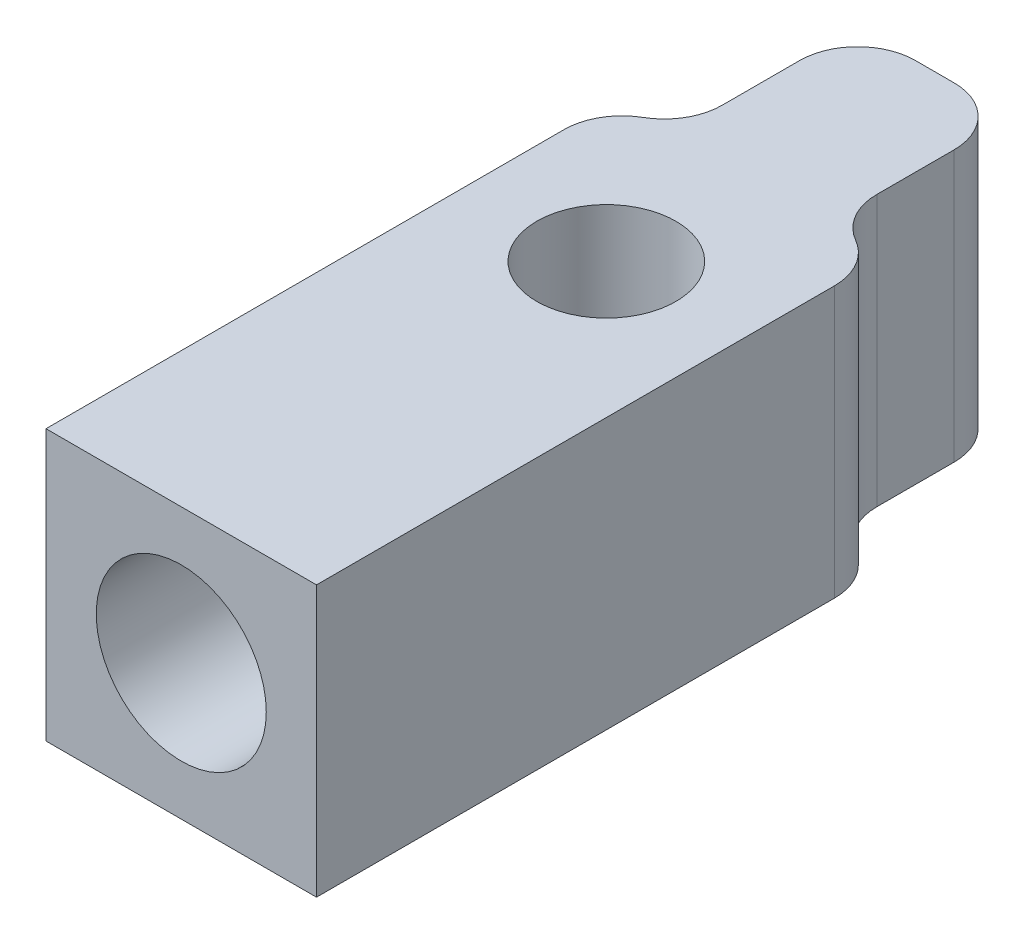
ISO-10303-21;
HEADER;
FILE_DESCRIPTION(('STEP AP214'),'2;1');
FILE_NAME('part.step','',(''),(''),'','','');
FILE_SCHEMA(('AUTOMOTIVE_DESIGN { 1 0 10303 214 1 1 1 1 }'));
ENDSEC;
DATA;
#1=APPLICATION_CONTEXT('core data for automotive mechanical design processes');
#2=APPLICATION_PROTOCOL_DEFINITION('international standard','automotive_design',2000,#1);
#3=PRODUCT_CONTEXT('',#1,'mechanical');
#4=PRODUCT('Part','Part','',(#3));
#5=PRODUCT_RELATED_PRODUCT_CATEGORY('part','',(#4));
#6=PRODUCT_DEFINITION_FORMATION('','',#4);
#7=PRODUCT_DEFINITION_CONTEXT('part definition',#1,'design');
#8=PRODUCT_DEFINITION('design','',#6,#7);
#9=PRODUCT_DEFINITION_SHAPE('','',#8);
#10=(LENGTH_UNIT() NAMED_UNIT(*) SI_UNIT(.MILLI.,.METRE.));
#11=(NAMED_UNIT(*) PLANE_ANGLE_UNIT() SI_UNIT($,.RADIAN.));
#12=(NAMED_UNIT(*) SI_UNIT($,.STERADIAN.) SOLID_ANGLE_UNIT());
#13=UNCERTAINTY_MEASURE_WITH_UNIT(LENGTH_MEASURE(1.E-05),#10,'distance_accuracy_value','');
#14=(GEOMETRIC_REPRESENTATION_CONTEXT(3) GLOBAL_UNCERTAINTY_ASSIGNED_CONTEXT((#13)) GLOBAL_UNIT_ASSIGNED_CONTEXT((#10,
#11,#12)) REPRESENTATION_CONTEXT('',''));
#15=CARTESIAN_POINT('',(0.,0.,0.));
#16=DIRECTION('',(0.,0.,1.));
#17=DIRECTION('',(1.,0.,0.));
#18=AXIS2_PLACEMENT_3D('',#15,#16,#17);
#19=CARTESIAN_POINT('',(-3.49999999999999,0.,0.));
#20=DIRECTION('',(-1.,0.,0.));
#21=DIRECTION('',(0.,-1.,0.));
#22=AXIS2_PLACEMENT_3D('',#19,#20,#21);
#23=PLANE('',#22);
#24=DIRECTION('',(0.,0.,-1.));
#25=VECTOR('',#24,1.);
#26=CARTESIAN_POINT('',(-3.49999999999999,8.5,11.));
#27=LINE('',#26,#25);
#28=CARTESIAN_POINT('',(-3.49999999999999,8.5,11.));
#29=VERTEX_POINT('',#28);
#30=CARTESIAN_POINT('',(-3.49999999999999,8.5,-2.4019237714403));
#31=VERTEX_POINT('',#30);
#32=EDGE_CURVE('E187',#29,#31,#27,.T.);
#33=ORIENTED_EDGE('',*,*,#32,.T.);
#34=DIRECTION('',(0.,1.,0.));
#35=VECTOR('',#34,1.);
#36=CARTESIAN_POINT('',(-3.49999999999999,1.5,-2.4019237714403));
#37=LINE('',#36,#35);
#38=CARTESIAN_POINT('',(-3.49999999999999,1.5,-2.4019237714403));
#39=VERTEX_POINT('',#38);
#40=EDGE_CURVE('E158',#39,#31,#37,.T.);
#41=ORIENTED_EDGE('',*,*,#40,.F.);
#42=DIRECTION('',(0.,0.,1.));
#43=VECTOR('',#42,1.);
#44=CARTESIAN_POINT('',(-3.49999999999999,1.5,-8.49999999999999));
#45=LINE('',#44,#43);
#46=CARTESIAN_POINT('',(-3.49999999999999,1.5,11.));
#47=VERTEX_POINT('',#46);
#48=EDGE_CURVE('E145',#39,#47,#45,.T.);
#49=ORIENTED_EDGE('',*,*,#48,.T.);
#50=DIRECTION('',(0.,1.,0.));
#51=VECTOR('',#50,1.);
#52=CARTESIAN_POINT('',(-3.49999999999999,1.5,11.));
#53=LINE('',#52,#51);
#54=EDGE_CURVE('E195',#47,#29,#53,.T.);
#55=ORIENTED_EDGE('',*,*,#54,.T.);
#56=EDGE_LOOP('',(#33,#41,#49,#55));
#57=FACE_BOUND('',#56,.T.);
#58=ADVANCED_FACE('F33',(#57),#23,.T.);
#59=CARTESIAN_POINT('',(3.49999999999999,8.5,11.));
#60=DIRECTION('',(0.,1.,0.));
#61=DIRECTION('',(-1.,0.,0.));
#62=AXIS2_PLACEMENT_3D('',#59,#60,#61);
#63=PLANE('',#62);
#64=CARTESIAN_POINT('',(0.,8.5,0.));
#65=DIRECTION('',(0.,1.,0.));
#66=DIRECTION('',(-1.,0.,0.));
#67=AXIS2_PLACEMENT_3D('',#64,#65,#66);
#68=CIRCLE('',#67,1.8);
#69=CARTESIAN_POINT('',(-1.8,8.5,0.));
#70=VERTEX_POINT('',#69);
#71=EDGE_CURVE('E156',#70,#70,#68,.T.);
#72=ORIENTED_EDGE('',*,*,#71,.F.);
#73=EDGE_LOOP('',(#72));
#74=FACE_BOUND('',#73,.T.);
#75=DIRECTION('',(-1.,0.,0.));
#76=VECTOR('',#75,1.);
#77=CARTESIAN_POINT('',(3.49999999999999,8.5,-8.49999999999999));
#78=LINE('',#77,#76);
#79=CARTESIAN_POINT('',(0.500000029802321,8.5,-8.49999999999999));
#80=VERTEX_POINT('',#79);
#81=CARTESIAN_POINT('',(-0.499999970197678,8.5,-8.49999999999999));
#82=VERTEX_POINT('',#81);
#83=EDGE_CURVE('E200',#80,#82,#78,.T.);
#84=ORIENTED_EDGE('',*,*,#83,.T.);
#85=CARTESIAN_POINT('',(-0.49999997019768,8.5,-6.99999999999999));
#86=DIRECTION('',(0.,1.,0.));
#87=DIRECTION('',(-1.,0.,0.));
#88=AXIS2_PLACEMENT_3D('',#85,#86,#87);
#89=CIRCLE('',#88,1.5);
#90=CARTESIAN_POINT('',(-1.99999997019768,8.5,-6.99999999999999));
#91=VERTEX_POINT('',#90);
#92=EDGE_CURVE('E216',#82,#91,#89,.T.);
#93=ORIENTED_EDGE('',*,*,#92,.T.);
#94=DIRECTION('',(0.,0.,-1.));
#95=VECTOR('',#94,1.);
#96=CARTESIAN_POINT('',(-1.99999997019768,8.5,-4.99999999999999));
#97=LINE('',#96,#95);
#98=CARTESIAN_POINT('',(-1.99999997019768,8.5,-4.99999999999999));
#99=VERTEX_POINT('',#98);
#100=EDGE_CURVE('E146',#99,#91,#97,.T.);
#101=ORIENTED_EDGE('',*,*,#100,.F.);
#102=CARTESIAN_POINT('',(-3.49999997019768,8.5,-4.99999999999999));
#103=DIRECTION('',(0.,1.,0.));
#104=DIRECTION('',(-1.,0.,0.));
#105=AXIS2_PLACEMENT_3D('',#102,#103,#104);
#106=CIRCLE('',#105,1.5);
#107=CARTESIAN_POINT('',(-2.74999998509883,8.5,-3.70096188572015));
#108=VERTEX_POINT('',#107);
#109=EDGE_CURVE('E148',#108,#99,#106,.T.);
#110=ORIENTED_EDGE('',*,*,#109,.F.);
#111=CARTESIAN_POINT('',(-1.99999999999999,8.5,-2.4019237714403));
#112=DIRECTION('',(0.,-1.,0.));
#113=DIRECTION('',(1.,0.,0.));
#114=AXIS2_PLACEMENT_3D('',#111,#112,#113);
#115=CIRCLE('',#114,1.5);
#116=EDGE_CURVE('E131',#31,#108,#115,.T.);
#117=ORIENTED_EDGE('',*,*,#116,.F.);
#118=ORIENTED_EDGE('',*,*,#32,.F.);
#119=DIRECTION('',(-1.,0.,0.));
#120=VECTOR('',#119,1.);
#121=CARTESIAN_POINT('',(3.49999999999999,8.5,11.));
#122=LINE('',#121,#120);
#123=CARTESIAN_POINT('',(3.49999999999999,8.5,11.));
#124=VERTEX_POINT('',#123);
#125=EDGE_CURVE('E204',#124,#29,#122,.T.);
#126=ORIENTED_EDGE('',*,*,#125,.F.);
#127=DIRECTION('',(0.,0.,-1.));
#128=VECTOR('',#127,1.);
#129=CARTESIAN_POINT('',(3.49999999999999,8.5,11.));
#130=LINE('',#129,#128);
#131=CARTESIAN_POINT('',(3.49999999999999,8.5,-2.40192380585306));
#132=VERTEX_POINT('',#131);
#133=EDGE_CURVE('E190',#124,#132,#130,.T.);
#134=ORIENTED_EDGE('',*,*,#133,.T.);
#135=CARTESIAN_POINT('',(1.99999999999999,8.5,-2.40192380585306));
#136=DIRECTION('',(0.,-1.,0.));
#137=DIRECTION('',(1.,0.,0.));
#138=AXIS2_PLACEMENT_3D('',#135,#136,#137);
#139=CIRCLE('',#138,1.5);
#140=CARTESIAN_POINT('',(2.75000001490115,8.5,-3.70096190292653));
#141=VERTEX_POINT('',#140);
#142=EDGE_CURVE('E174',#141,#132,#139,.T.);
#143=ORIENTED_EDGE('',*,*,#142,.F.);
#144=CARTESIAN_POINT('',(3.50000002980232,8.5,-4.99999999999999));
#145=DIRECTION('',(0.,1.,0.));
#146=DIRECTION('',(-1.,0.,0.));
#147=AXIS2_PLACEMENT_3D('',#144,#145,#146);
#148=CIRCLE('',#147,1.5);
#149=CARTESIAN_POINT('',(2.00000002980232,8.5,-4.99999999999999));
#150=VERTEX_POINT('',#149);
#151=EDGE_CURVE('E160',#150,#141,#148,.T.);
#152=ORIENTED_EDGE('',*,*,#151,.F.);
#153=DIRECTION('',(0.,0.,1.));
#154=VECTOR('',#153,1.);
#155=CARTESIAN_POINT('',(2.00000002980232,8.5,-8.49999999999999));
#156=LINE('',#155,#154);
#157=CARTESIAN_POINT('',(2.00000002980232,8.5,-6.99999999999999));
#158=VERTEX_POINT('',#157);
#159=EDGE_CURVE('E166',#158,#150,#156,.T.);
#160=ORIENTED_EDGE('',*,*,#159,.F.);
#161=CARTESIAN_POINT('',(0.50000002980232,8.5,-6.99999999999999));
#162=DIRECTION('',(0.,1.,0.));
#163=DIRECTION('',(-1.,0.,0.));
#164=AXIS2_PLACEMENT_3D('',#161,#162,#163);
#165=CIRCLE('',#164,1.5);
#166=EDGE_CURVE('E214',#158,#80,#165,.T.);
#167=ORIENTED_EDGE('',*,*,#166,.T.);
#168=EDGE_LOOP('',(#84,#93,#101,#110,#117,#118,#126,#134,#143,#152,#160,#167));
#169=FACE_BOUND('',#168,.T.);
#170=ADVANCED_FACE('F229',(#74,#169),#63,.T.);
#171=CARTESIAN_POINT('',(3.49999999999999,1.5,-8.49999999999999));
#172=DIRECTION('',(0.,-1.,0.));
#173=DIRECTION('',(1.,0.,0.));
#174=AXIS2_PLACEMENT_3D('',#171,#172,#173);
#175=PLANE('',#174);
#176=CARTESIAN_POINT('',(0.,1.5,0.));
#177=DIRECTION('',(0.,-1.,0.));
#178=DIRECTION('',(1.,0.,0.));
#179=AXIS2_PLACEMENT_3D('',#176,#177,#178);
#180=CIRCLE('',#179,1.8);
#181=CARTESIAN_POINT('',(1.8,1.5,0.));
#182=VERTEX_POINT('',#181);
#183=EDGE_CURVE('E151',#182,#182,#180,.F.);
#184=ORIENTED_EDGE('',*,*,#183,.T.);
#185=EDGE_LOOP('',(#184));
#186=FACE_BOUND('',#185,.T.);
#187=DIRECTION('',(0.,0.,-1.));
#188=VECTOR('',#187,1.);
#189=CARTESIAN_POINT('',(-1.99999997019768,1.5,-4.99999999999999));
#190=LINE('',#189,#188);
#191=CARTESIAN_POINT('',(-1.99999997019768,1.5,-4.99999999999999));
#192=VERTEX_POINT('',#191);
#193=CARTESIAN_POINT('',(-1.99999997019768,1.5,-6.99999999999999));
#194=VERTEX_POINT('',#193);
#195=EDGE_CURVE('E136',#192,#194,#190,.T.);
#196=ORIENTED_EDGE('',*,*,#195,.T.);
#197=CARTESIAN_POINT('',(-0.499999970197678,1.5,-6.99999999999999));
#198=DIRECTION('',(0.,-1.,0.));
#199=DIRECTION('',(1.,0.,0.));
#200=AXIS2_PLACEMENT_3D('',#197,#198,#199);
#201=CIRCLE('',#200,1.5);
#202=CARTESIAN_POINT('',(-0.499999970197677,1.5,-8.49999999999999));
#203=VERTEX_POINT('',#202);
#204=EDGE_CURVE('E41',#194,#203,#201,.T.);
#205=ORIENTED_EDGE('',*,*,#204,.T.);
#206=DIRECTION('',(-1.,0.,0.));
#207=VECTOR('',#206,1.);
#208=CARTESIAN_POINT('',(3.49999999999999,1.5,-8.49999999999999));
#209=LINE('',#208,#207);
#210=CARTESIAN_POINT('',(0.500000029802322,1.5,-8.49999999999999));
#211=VERTEX_POINT('',#210);
#212=EDGE_CURVE('E193',#211,#203,#209,.T.);
#213=ORIENTED_EDGE('',*,*,#212,.F.);
#214=CARTESIAN_POINT('',(0.500000029802321,1.5,-6.99999999999999));
#215=DIRECTION('',(0.,-1.,0.));
#216=DIRECTION('',(1.,0.,0.));
#217=AXIS2_PLACEMENT_3D('',#214,#215,#216);
#218=CIRCLE('',#217,1.5);
#219=CARTESIAN_POINT('',(2.00000002980232,1.5,-6.99999999999999));
#220=VERTEX_POINT('',#219);
#221=EDGE_CURVE('E48',#211,#220,#218,.T.);
#222=ORIENTED_EDGE('',*,*,#221,.T.);
#223=DIRECTION('',(0.,0.,1.));
#224=VECTOR('',#223,1.);
#225=CARTESIAN_POINT('',(2.00000002980232,1.5,-8.49999999999999));
#226=LINE('',#225,#224);
#227=CARTESIAN_POINT('',(2.00000002980232,1.5,-4.99999999999999));
#228=VERTEX_POINT('',#227);
#229=EDGE_CURVE('E169',#220,#228,#226,.T.);
#230=ORIENTED_EDGE('',*,*,#229,.T.);
#231=CARTESIAN_POINT('',(3.50000002980232,1.5,-4.99999999999999));
#232=DIRECTION('',(0.,1.,0.));
#233=DIRECTION('',(-1.,0.,0.));
#234=AXIS2_PLACEMENT_3D('',#231,#232,#233);
#235=CIRCLE('',#234,1.5);
#236=CARTESIAN_POINT('',(2.75000001490116,1.5,-3.70096190292653));
#237=VERTEX_POINT('',#236);
#238=EDGE_CURVE('E162',#228,#237,#235,.T.);
#239=ORIENTED_EDGE('',*,*,#238,.T.);
#240=CARTESIAN_POINT('',(1.99999999999999,1.5,-2.40192380585306));
#241=DIRECTION('',(0.,-1.,0.));
#242=DIRECTION('',(1.,0.,0.));
#243=AXIS2_PLACEMENT_3D('',#240,#241,#242);
#244=CIRCLE('',#243,1.5);
#245=CARTESIAN_POINT('',(3.49999999999999,1.5,-2.40192380585306));
#246=VERTEX_POINT('',#245);
#247=EDGE_CURVE('E165',#237,#246,#244,.T.);
#248=ORIENTED_EDGE('',*,*,#247,.T.);
#249=DIRECTION('',(0.,0.,1.));
#250=VECTOR('',#249,1.);
#251=CARTESIAN_POINT('',(3.49999999999999,1.5,-8.49999999999999));
#252=LINE('',#251,#250);
#253=CARTESIAN_POINT('',(3.49999999999999,1.5,11.));
#254=VERTEX_POINT('',#253);
#255=EDGE_CURVE('E184',#246,#254,#252,.T.);
#256=ORIENTED_EDGE('',*,*,#255,.T.);
#257=DIRECTION('',(-1.,0.,0.));
#258=VECTOR('',#257,1.);
#259=CARTESIAN_POINT('',(3.49999999999999,1.5,11.));
#260=LINE('',#259,#258);
#261=EDGE_CURVE('E206',#254,#47,#260,.T.);
#262=ORIENTED_EDGE('',*,*,#261,.T.);
#263=ORIENTED_EDGE('',*,*,#48,.F.);
#264=CARTESIAN_POINT('',(-1.99999999999999,1.5,-2.4019237714403));
#265=DIRECTION('',(0.,-1.,0.));
#266=DIRECTION('',(1.,0.,0.));
#267=AXIS2_PLACEMENT_3D('',#264,#265,#266);
#268=CIRCLE('',#267,1.5);
#269=CARTESIAN_POINT('',(-2.74999998509883,1.5,-3.70096188572015));
#270=VERTEX_POINT('',#269);
#271=EDGE_CURVE('E128',#39,#270,#268,.T.);
#272=ORIENTED_EDGE('',*,*,#271,.T.);
#273=CARTESIAN_POINT('',(-3.49999997019768,1.5,-4.99999999999999));
#274=DIRECTION('',(0.,1.,0.));
#275=DIRECTION('',(-1.,0.,0.));
#276=AXIS2_PLACEMENT_3D('',#273,#274,#275);
#277=CIRCLE('',#276,1.5);
#278=EDGE_CURVE('E139',#270,#192,#277,.T.);
#279=ORIENTED_EDGE('',*,*,#278,.T.);
#280=EDGE_LOOP('',(#196,#205,#213,#222,#230,#239,#248,#256,#262,#263,#272,#279));
#281=FACE_BOUND('',#280,.T.);
#282=ADVANCED_FACE('F143',(#186,#281),#175,.T.);
#283=CARTESIAN_POINT('',(3.49999999999999,0.,0.));
#284=DIRECTION('',(-1.,0.,0.));
#285=DIRECTION('',(0.,-1.,0.));
#286=AXIS2_PLACEMENT_3D('',#283,#284,#285);
#287=PLANE('',#286);
#288=DIRECTION('',(0.,1.,0.));
#289=VECTOR('',#288,1.);
#290=CARTESIAN_POINT('',(3.49999999999999,1.5,-2.40192380585306));
#291=LINE('',#290,#289);
#292=EDGE_CURVE('E180',#246,#132,#291,.T.);
#293=ORIENTED_EDGE('',*,*,#292,.T.);
#294=ORIENTED_EDGE('',*,*,#133,.F.);
#295=DIRECTION('',(0.,1.,0.));
#296=VECTOR('',#295,1.);
#297=CARTESIAN_POINT('',(3.49999999999999,1.5,11.));
#298=LINE('',#297,#296);
#299=EDGE_CURVE('E186',#254,#124,#298,.T.);
#300=ORIENTED_EDGE('',*,*,#299,.F.);
#301=ORIENTED_EDGE('',*,*,#255,.F.);
#302=EDGE_LOOP('',(#293,#294,#300,#301));
#303=FACE_BOUND('',#302,.T.);
#304=ADVANCED_FACE('F242',(#303),#287,.F.);
#305=CARTESIAN_POINT('',(3.49999999999999,8.5,-8.49999999999999));
#306=DIRECTION('',(0.,0.,-1.));
#307=DIRECTION('',(-1.,0.,0.));
#308=AXIS2_PLACEMENT_3D('',#305,#306,#307);
#309=PLANE('',#308);
#310=ORIENTED_EDGE('',*,*,#212,.T.);
#311=DIRECTION('',(0.,1.,0.));
#312=VECTOR('',#311,1.);
#313=CARTESIAN_POINT('',(-0.49999997019768,8.5,-8.49999999999999));
#314=LINE('',#313,#312);
#315=EDGE_CURVE('E211',#203,#82,#314,.T.);
#316=ORIENTED_EDGE('',*,*,#315,.T.);
#317=ORIENTED_EDGE('',*,*,#83,.F.);
#318=DIRECTION('',(0.,1.,0.));
#319=VECTOR('',#318,1.);
#320=CARTESIAN_POINT('',(0.500000029802321,1.5,-8.49999999999999));
#321=LINE('',#320,#319);
#322=EDGE_CURVE('E203',#80,#211,#321,.F.);
#323=ORIENTED_EDGE('',*,*,#322,.T.);
#324=EDGE_LOOP('',(#310,#316,#317,#323));
#325=FACE_BOUND('',#324,.T.);
#326=ADVANCED_FACE('F223',(#325),#309,.T.);
#327=CARTESIAN_POINT('',(3.49999999999999,1.5,11.));
#328=DIRECTION('',(0.,0.,1.));
#329=DIRECTION('',(1.,0.,0.));
#330=AXIS2_PLACEMENT_3D('',#327,#328,#329);
#331=PLANE('',#330);
#332=CARTESIAN_POINT('',(0.,5.,11.));
#333=DIRECTION('',(0.,0.,1.));
#334=DIRECTION('',(1.,0.,0.));
#335=AXIS2_PLACEMENT_3D('',#332,#333,#334);
#336=CIRCLE('',#335,2.2);
#337=CARTESIAN_POINT('',(2.2,5.,11.));
#338=VERTEX_POINT('',#337);
#339=EDGE_CURVE('E395',#338,#338,#336,.T.);
#340=ORIENTED_EDGE('',*,*,#339,.F.);
#341=EDGE_LOOP('',(#340));
#342=FACE_BOUND('',#341,.T.);
#343=ORIENTED_EDGE('',*,*,#54,.F.);
#344=ORIENTED_EDGE('',*,*,#261,.F.);
#345=ORIENTED_EDGE('',*,*,#299,.T.);
#346=ORIENTED_EDGE('',*,*,#125,.T.);
#347=EDGE_LOOP('',(#343,#344,#345,#346));
#348=FACE_BOUND('',#347,.T.);
#349=ADVANCED_FACE('F236',(#342,#348),#331,.T.);
#350=CARTESIAN_POINT('',(3.50000002980232,1.5,-4.99999999999999));
#351=DIRECTION('',(0.,1.,0.));
#352=DIRECTION('',(-1.,0.,0.));
#353=AXIS2_PLACEMENT_3D('',#350,#351,#352);
#354=CYLINDRICAL_SURFACE('',#353,1.5);
#355=ORIENTED_EDGE('',*,*,#151,.T.);
#356=DIRECTION('',(0.,1.,0.));
#357=VECTOR('',#356,1.);
#358=CARTESIAN_POINT('',(2.75000001490116,1.5,-3.70096190292653));
#359=LINE('',#358,#357);
#360=EDGE_CURVE('E171',#237,#141,#359,.T.);
#361=ORIENTED_EDGE('',*,*,#360,.F.);
#362=ORIENTED_EDGE('',*,*,#238,.F.);
#363=DIRECTION('',(0.,1.,0.));
#364=VECTOR('',#363,1.);
#365=CARTESIAN_POINT('',(2.00000002980232,1.5,-4.99999999999999));
#366=LINE('',#365,#364);
#367=EDGE_CURVE('E177',#228,#150,#366,.T.);
#368=ORIENTED_EDGE('',*,*,#367,.T.);
#369=EDGE_LOOP('',(#355,#361,#362,#368));
#370=FACE_BOUND('',#369,.T.);
#371=ADVANCED_FACE('F250',(#370),#354,.F.);
#372=CARTESIAN_POINT('',(2.00000002980232,1.5,-8.49999999999999));
#373=DIRECTION('',(-1.,0.,0.));
#374=DIRECTION('',(0.,-1.,0.));
#375=AXIS2_PLACEMENT_3D('',#372,#373,#374);
#376=PLANE('',#375);
#377=ORIENTED_EDGE('',*,*,#229,.F.);
#378=DIRECTION('',(0.,1.,0.));
#379=VECTOR('',#378,1.);
#380=CARTESIAN_POINT('',(2.00000002980232,8.5,-6.99999999999999));
#381=LINE('',#380,#379);
#382=EDGE_CURVE('E11',#220,#158,#381,.T.);
#383=ORIENTED_EDGE('',*,*,#382,.T.);
#384=ORIENTED_EDGE('',*,*,#159,.T.);
#385=ORIENTED_EDGE('',*,*,#367,.F.);
#386=EDGE_LOOP('',(#377,#383,#384,#385));
#387=FACE_BOUND('',#386,.T.);
#388=ADVANCED_FACE('F253',(#387),#376,.F.);
#389=CARTESIAN_POINT('',(1.99999999999999,1.5,-2.40192380585306));
#390=DIRECTION('',(0.,1.,0.));
#391=DIRECTION('',(-1.,0.,0.));
#392=AXIS2_PLACEMENT_3D('',#389,#390,#391);
#393=CYLINDRICAL_SURFACE('',#392,1.5);
#394=ORIENTED_EDGE('',*,*,#142,.T.);
#395=ORIENTED_EDGE('',*,*,#292,.F.);
#396=ORIENTED_EDGE('',*,*,#247,.F.);
#397=ORIENTED_EDGE('',*,*,#360,.T.);
#398=EDGE_LOOP('',(#394,#395,#396,#397));
#399=FACE_BOUND('',#398,.T.);
#400=ADVANCED_FACE('F246',(#399),#393,.T.);
#401=CARTESIAN_POINT('',(-1.99999999999999,1.5,-2.4019237714403));
#402=DIRECTION('',(0.,1.,0.));
#403=DIRECTION('',(-1.,0.,0.));
#404=AXIS2_PLACEMENT_3D('',#401,#402,#403);
#405=CYLINDRICAL_SURFACE('',#404,1.5);
#406=ORIENTED_EDGE('',*,*,#116,.T.);
#407=DIRECTION('',(0.,1.,0.));
#408=VECTOR('',#407,1.);
#409=CARTESIAN_POINT('',(-2.74999998509883,1.5,-3.70096188572015));
#410=LINE('',#409,#408);
#411=EDGE_CURVE('E124',#270,#108,#410,.T.);
#412=ORIENTED_EDGE('',*,*,#411,.F.);
#413=ORIENTED_EDGE('',*,*,#271,.F.);
#414=ORIENTED_EDGE('',*,*,#40,.T.);
#415=EDGE_LOOP('',(#406,#412,#413,#414));
#416=FACE_BOUND('',#415,.T.);
#417=ADVANCED_FACE('F126',(#416),#405,.T.);
#418=CARTESIAN_POINT('',(-1.99999997019768,1.5,-4.99999999999999));
#419=DIRECTION('',(1.,0.,0.));
#420=DIRECTION('',(0.,1.,0.));
#421=AXIS2_PLACEMENT_3D('',#418,#419,#420);
#422=PLANE('',#421);
#423=ORIENTED_EDGE('',*,*,#100,.T.);
#424=DIRECTION('',(0.,1.,0.));
#425=VECTOR('',#424,1.);
#426=CARTESIAN_POINT('',(-1.99999997019768,1.5,-6.99999999999999));
#427=LINE('',#426,#425);
#428=EDGE_CURVE('E56',#91,#194,#427,.F.);
#429=ORIENTED_EDGE('',*,*,#428,.T.);
#430=ORIENTED_EDGE('',*,*,#195,.F.);
#431=DIRECTION('',(0.,1.,0.));
#432=VECTOR('',#431,1.);
#433=CARTESIAN_POINT('',(-1.99999997019768,1.5,-4.99999999999999));
#434=LINE('',#433,#432);
#435=EDGE_CURVE('E135',#192,#99,#434,.T.);
#436=ORIENTED_EDGE('',*,*,#435,.T.);
#437=EDGE_LOOP('',(#423,#429,#430,#436));
#438=FACE_BOUND('',#437,.T.);
#439=ADVANCED_FACE('F230',(#438),#422,.F.);
#440=CARTESIAN_POINT('',(-3.49999997019768,1.5,-4.99999999999999));
#441=DIRECTION('',(0.,1.,0.));
#442=DIRECTION('',(-1.,0.,0.));
#443=AXIS2_PLACEMENT_3D('',#440,#441,#442);
#444=CYLINDRICAL_SURFACE('',#443,1.5);
#445=ORIENTED_EDGE('',*,*,#109,.T.);
#446=ORIENTED_EDGE('',*,*,#435,.F.);
#447=ORIENTED_EDGE('',*,*,#278,.F.);
#448=ORIENTED_EDGE('',*,*,#411,.T.);
#449=EDGE_LOOP('',(#445,#446,#447,#448));
#450=FACE_BOUND('',#449,.T.);
#451=ADVANCED_FACE('F140',(#450),#444,.F.);
#452=CARTESIAN_POINT('',(-0.49999997019768,8.5,-6.99999999999999));
#453=DIRECTION('',(0.,-1.,0.));
#454=DIRECTION('',(1.,0.,0.));
#455=AXIS2_PLACEMENT_3D('',#452,#453,#454);
#456=CYLINDRICAL_SURFACE('',#455,1.5);
#457=ORIENTED_EDGE('',*,*,#204,.F.);
#458=ORIENTED_EDGE('',*,*,#428,.F.);
#459=ORIENTED_EDGE('',*,*,#92,.F.);
#460=ORIENTED_EDGE('',*,*,#315,.F.);
#461=EDGE_LOOP('',(#457,#458,#459,#460));
#462=FACE_BOUND('',#461,.T.);
#463=ADVANCED_FACE('F226',(#462),#456,.T.);
#464=CARTESIAN_POINT('',(0.500000029802321,1.5,-6.99999999999999));
#465=DIRECTION('',(0.,-1.,0.));
#466=DIRECTION('',(1.,0.,0.));
#467=AXIS2_PLACEMENT_3D('',#464,#465,#466);
#468=CYLINDRICAL_SURFACE('',#467,1.5);
#469=ORIENTED_EDGE('',*,*,#221,.F.);
#470=ORIENTED_EDGE('',*,*,#322,.F.);
#471=ORIENTED_EDGE('',*,*,#166,.F.);
#472=ORIENTED_EDGE('',*,*,#382,.F.);
#473=EDGE_LOOP('',(#469,#470,#471,#472));
#474=FACE_BOUND('',#473,.T.);
#475=ADVANCED_FACE('F35',(#474),#468,.T.);
#476=CARTESIAN_POINT('',(0.,1.499,0.));
#477=DIRECTION('',(0.,1.,0.));
#478=DIRECTION('',(-1.,0.,0.));
#479=AXIS2_PLACEMENT_3D('',#476,#477,#478);
#480=CYLINDRICAL_SURFACE('',#479,1.8);
#481=ORIENTED_EDGE('',*,*,#183,.F.);
#482=EDGE_LOOP('',(#481));
#483=FACE_BOUND('',#482,.T.);
#484=ORIENTED_EDGE('',*,*,#71,.T.);
#485=EDGE_LOOP('',(#484));
#486=FACE_BOUND('',#485,.T.);
#487=ADVANCED_FACE('F257',(#483,#486),#480,.F.);
#488=CARTESIAN_POINT('',(0.,5.,4.));
#489=DIRECTION('',(0.,0.,1.));
#490=DIRECTION('',(1.,0.,0.));
#491=AXIS2_PLACEMENT_3D('',#488,#489,#490);
#492=CYLINDRICAL_SURFACE('',#491,2.2);
#493=CARTESIAN_POINT('',(0.,5.,4.));
#494=DIRECTION('',(0.,0.,1.));
#495=DIRECTION('',(1.,0.,0.));
#496=AXIS2_PLACEMENT_3D('',#493,#494,#495);
#497=CIRCLE('',#496,2.2);
#498=CARTESIAN_POINT('',(2.2,5.,4.));
#499=VERTEX_POINT('',#498);
#500=EDGE_CURVE('E394',#499,#499,#497,.T.);
#501=ORIENTED_EDGE('',*,*,#500,.F.);
#502=EDGE_LOOP('',(#501));
#503=FACE_BOUND('',#502,.T.);
#504=ORIENTED_EDGE('',*,*,#339,.T.);
#505=EDGE_LOOP('',(#504));
#506=FACE_BOUND('',#505,.T.);
#507=ADVANCED_FACE('F262',(#503,#506),#492,.F.);
#508=CARTESIAN_POINT('',(0.,5.,4.));
#509=DIRECTION('',(0.,0.,1.));
#510=DIRECTION('',(1.,0.,0.));
#511=AXIS2_PLACEMENT_3D('',#508,#509,#510);
#512=PLANE('',#511);
#513=ORIENTED_EDGE('',*,*,#500,.T.);
#514=EDGE_LOOP('',(#513));
#515=FACE_BOUND('',#514,.T.);
#516=ADVANCED_FACE('F378',(#515),#512,.T.);
#517=CLOSED_SHELL('',(#58,#170,#282,#304,#326,#349,#371,#388,#400,#417,#439,#451,#463,#475,#487,
#507,#516));
#518=MANIFOLD_SOLID_BREP('B2',#517);
#519=ADVANCED_BREP_SHAPE_REPRESENTATION('',(#18,#518),#14);
#520=SHAPE_DEFINITION_REPRESENTATION(#9,#519);
ENDSEC;
END-ISO-10303-21;
